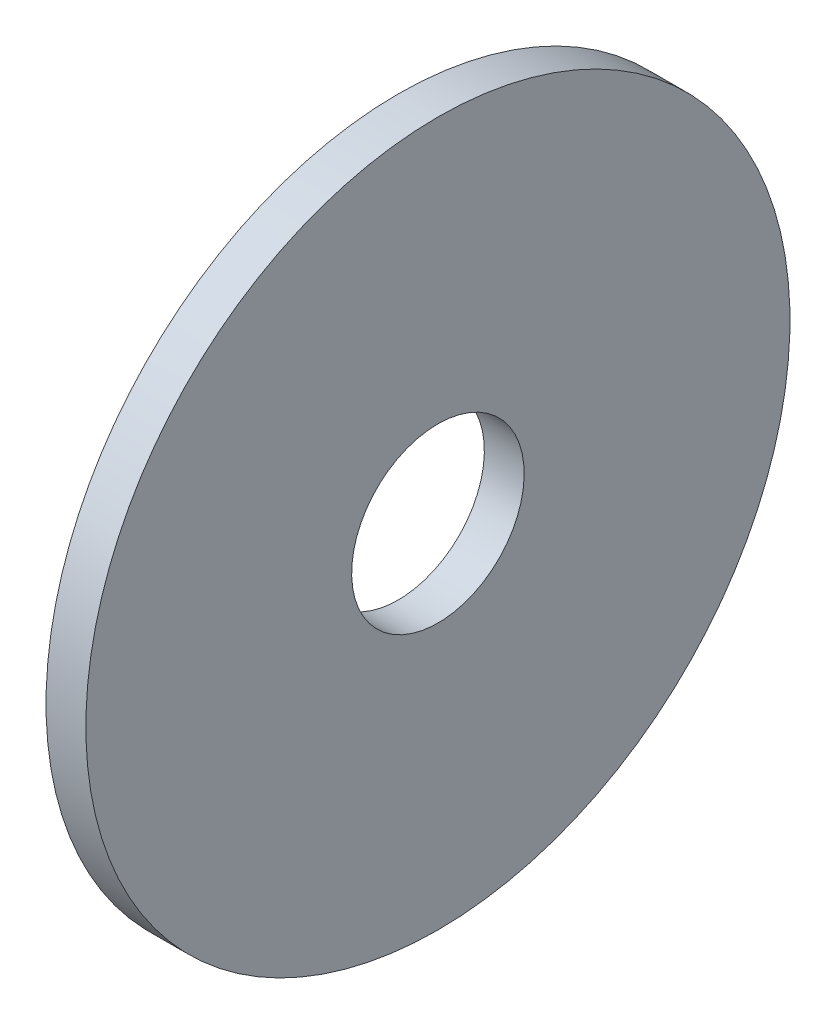
ISO-10303-21;
HEADER;
FILE_DESCRIPTION(('STEP AP214'),'2;1');
FILE_NAME('part.step','',(''),(''),'','','');
FILE_SCHEMA(('AUTOMOTIVE_DESIGN { 1 0 10303 214 1 1 1 1 }'));
ENDSEC;
DATA;
#1=APPLICATION_CONTEXT('core data for automotive mechanical design processes');
#2=APPLICATION_PROTOCOL_DEFINITION('international standard','automotive_design',2000,#1);
#3=PRODUCT_CONTEXT('',#1,'mechanical');
#4=PRODUCT('Part','Part','',(#3));
#5=PRODUCT_RELATED_PRODUCT_CATEGORY('part','',(#4));
#6=PRODUCT_DEFINITION_FORMATION('','',#4);
#7=PRODUCT_DEFINITION_CONTEXT('part definition',#1,'design');
#8=PRODUCT_DEFINITION('design','',#6,#7);
#9=PRODUCT_DEFINITION_SHAPE('','',#8);
#10=(LENGTH_UNIT() NAMED_UNIT(*) SI_UNIT(.MILLI.,.METRE.));
#11=(NAMED_UNIT(*) PLANE_ANGLE_UNIT() SI_UNIT($,.RADIAN.));
#12=(NAMED_UNIT(*) SI_UNIT($,.STERADIAN.) SOLID_ANGLE_UNIT());
#13=UNCERTAINTY_MEASURE_WITH_UNIT(LENGTH_MEASURE(1.E-05),#10,'distance_accuracy_value','');
#14=(GEOMETRIC_REPRESENTATION_CONTEXT(3) GLOBAL_UNCERTAINTY_ASSIGNED_CONTEXT((#13)) GLOBAL_UNIT_ASSIGNED_CONTEXT((#10,
#11,#12)) REPRESENTATION_CONTEXT('',''));
#15=CARTESIAN_POINT('',(0.,0.,0.));
#16=DIRECTION('',(0.,0.,1.));
#17=DIRECTION('',(1.,0.,0.));
#18=AXIS2_PLACEMENT_3D('',#15,#16,#17);
#19=CARTESIAN_POINT('',(600.,0.,0.));
#20=DIRECTION('',(1.,0.,0.));
#21=DIRECTION('',(0.,1.,0.));
#22=AXIS2_PLACEMENT_3D('',#19,#20,#21);
#23=CYLINDRICAL_SURFACE('',#22,13.);
#24=CARTESIAN_POINT('',(600.,0.,0.));
#25=DIRECTION('',(1.,0.,0.));
#26=DIRECTION('',(0.,1.,0.));
#27=AXIS2_PLACEMENT_3D('',#24,#25,#26);
#28=CIRCLE('',#27,13.);
#29=CARTESIAN_POINT('',(600.,13.,0.));
#30=VERTEX_POINT('',#29);
#31=EDGE_CURVE('E47',#30,#30,#28,.T.);
#32=ORIENTED_EDGE('',*,*,#31,.T.);
#33=EDGE_LOOP('',(#32));
#34=FACE_BOUND('',#33,.T.);
#35=CARTESIAN_POINT('',(594.,0.,0.));
#36=DIRECTION('',(1.,0.,0.));
#37=DIRECTION('',(0.,1.,0.));
#38=AXIS2_PLACEMENT_3D('',#35,#36,#37);
#39=CIRCLE('',#38,13.);
#40=CARTESIAN_POINT('',(594.,13.,0.));
#41=VERTEX_POINT('',#40);
#42=EDGE_CURVE('E54',#41,#41,#39,.T.);
#43=ORIENTED_EDGE('',*,*,#42,.F.);
#44=EDGE_LOOP('',(#43));
#45=FACE_BOUND('',#44,.T.);
#46=ADVANCED_FACE('F39',(#34,#45),#23,.F.);
#47=CARTESIAN_POINT('',(600.,2.32682891837997E-13,0.));
#48=DIRECTION('',(1.,0.,0.));
#49=DIRECTION('',(0.,1.,0.));
#50=AXIS2_PLACEMENT_3D('',#47,#48,#49);
#51=CYLINDRICAL_SURFACE('',#50,53.05);
#52=CARTESIAN_POINT('',(600.,2.32682891837997E-13,0.));
#53=DIRECTION('',(1.,0.,0.));
#54=DIRECTION('',(0.,1.,0.));
#55=AXIS2_PLACEMENT_3D('',#52,#53,#54);
#56=CIRCLE('',#55,53.05);
#57=CARTESIAN_POINT('',(600.,53.0500000000002,0.));
#58=VERTEX_POINT('',#57);
#59=EDGE_CURVE('E11',#58,#58,#56,.T.);
#60=ORIENTED_EDGE('',*,*,#59,.F.);
#61=EDGE_LOOP('',(#60));
#62=FACE_BOUND('',#61,.T.);
#63=CARTESIAN_POINT('',(594.,2.30845921639276E-13,0.));
#64=DIRECTION('',(1.,0.,0.));
#65=DIRECTION('',(0.,1.,0.));
#66=AXIS2_PLACEMENT_3D('',#63,#64,#65);
#67=CIRCLE('',#66,53.05);
#68=CARTESIAN_POINT('',(594.,53.0500000000002,0.));
#69=VERTEX_POINT('',#68);
#70=EDGE_CURVE('E43',#69,#69,#67,.T.);
#71=ORIENTED_EDGE('',*,*,#70,.T.);
#72=EDGE_LOOP('',(#71));
#73=FACE_BOUND('',#72,.T.);
#74=ADVANCED_FACE('F41',(#62,#73),#51,.T.);
#75=CARTESIAN_POINT('',(600.,2.32682891837997E-13,0.));
#76=DIRECTION('',(1.,0.,0.));
#77=DIRECTION('',(0.,1.,0.));
#78=AXIS2_PLACEMENT_3D('',#75,#76,#77);
#79=PLANE('',#78);
#80=ORIENTED_EDGE('',*,*,#31,.F.);
#81=EDGE_LOOP('',(#80));
#82=FACE_BOUND('',#81,.T.);
#83=ORIENTED_EDGE('',*,*,#59,.T.);
#84=EDGE_LOOP('',(#83));
#85=FACE_BOUND('',#84,.T.);
#86=ADVANCED_FACE('F64',(#82,#85),#79,.T.);
#87=CARTESIAN_POINT('',(594.,2.30845921639276E-13,0.));
#88=DIRECTION('',(1.,0.,0.));
#89=DIRECTION('',(0.,1.,0.));
#90=AXIS2_PLACEMENT_3D('',#87,#88,#89);
#91=PLANE('',#90);
#92=ORIENTED_EDGE('',*,*,#42,.T.);
#93=EDGE_LOOP('',(#92));
#94=FACE_BOUND('',#93,.T.);
#95=ORIENTED_EDGE('',*,*,#70,.F.);
#96=EDGE_LOOP('',(#95));
#97=FACE_BOUND('',#96,.T.);
#98=ADVANCED_FACE('F62',(#94,#97),#91,.F.);
#99=CLOSED_SHELL('',(#46,#74,#86,#98));
#100=MANIFOLD_SOLID_BREP('B2',#99);
#101=ADVANCED_BREP_SHAPE_REPRESENTATION('',(#18,#100),#14);
#102=SHAPE_DEFINITION_REPRESENTATION(#9,#101);
ENDSEC;
END-ISO-10303-21;
